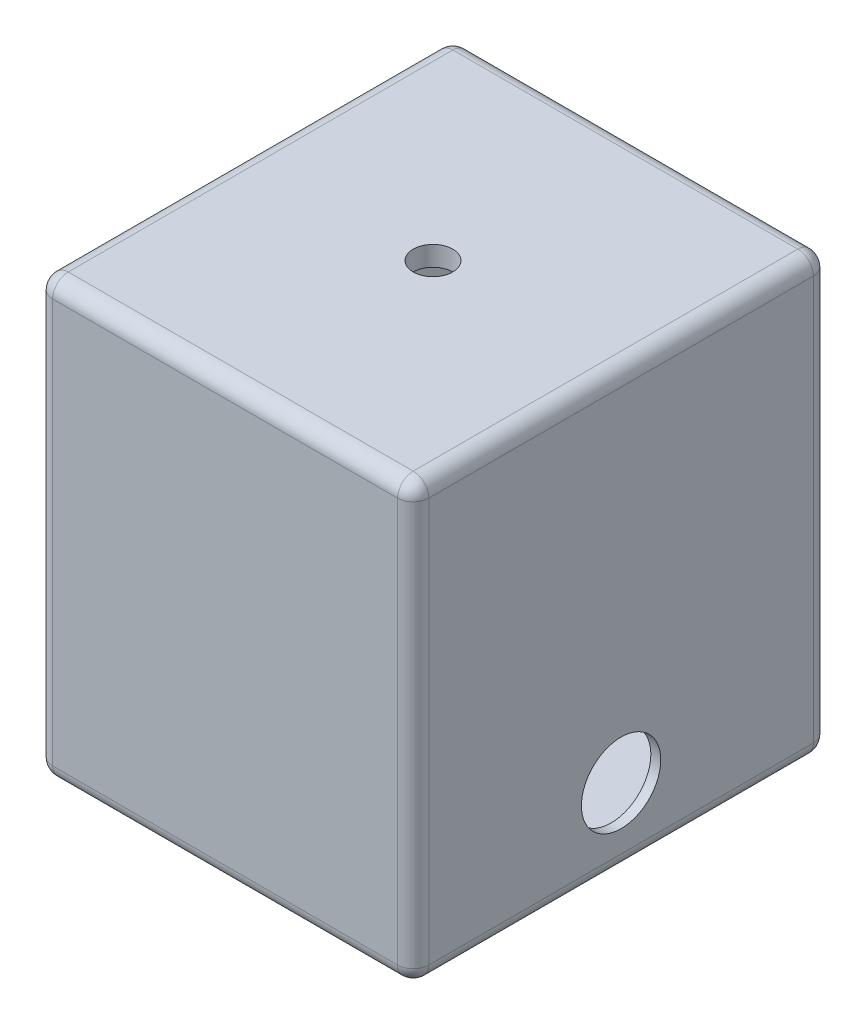
ISO-10303-21;
HEADER;
FILE_DESCRIPTION(('STEP AP214'),'2;1');
FILE_NAME('part.step','',(''),(''),'','','');
FILE_SCHEMA(('AUTOMOTIVE_DESIGN { 1 0 10303 214 1 1 1 1 }'));
ENDSEC;
DATA;
#1=APPLICATION_CONTEXT('core data for automotive mechanical design processes');
#2=APPLICATION_PROTOCOL_DEFINITION('international standard','automotive_design',2000,#1);
#3=PRODUCT_CONTEXT('',#1,'mechanical');
#4=PRODUCT('Part','Part','',(#3));
#5=PRODUCT_RELATED_PRODUCT_CATEGORY('part','',(#4));
#6=PRODUCT_DEFINITION_FORMATION('','',#4);
#7=PRODUCT_DEFINITION_CONTEXT('part definition',#1,'design');
#8=PRODUCT_DEFINITION('design','',#6,#7);
#9=PRODUCT_DEFINITION_SHAPE('','',#8);
#10=(LENGTH_UNIT() NAMED_UNIT(*) SI_UNIT(.MILLI.,.METRE.));
#11=(NAMED_UNIT(*) PLANE_ANGLE_UNIT() SI_UNIT($,.RADIAN.));
#12=(NAMED_UNIT(*) SI_UNIT($,.STERADIAN.) SOLID_ANGLE_UNIT());
#13=UNCERTAINTY_MEASURE_WITH_UNIT(LENGTH_MEASURE(1.E-05),#10,'distance_accuracy_value','');
#14=(GEOMETRIC_REPRESENTATION_CONTEXT(3) GLOBAL_UNCERTAINTY_ASSIGNED_CONTEXT((#13)) GLOBAL_UNIT_ASSIGNED_CONTEXT((#10,
#11,#12)) REPRESENTATION_CONTEXT('',''));
#15=CARTESIAN_POINT('',(0.,0.,0.));
#16=DIRECTION('',(0.,0.,1.));
#17=DIRECTION('',(1.,0.,0.));
#18=AXIS2_PLACEMENT_3D('',#15,#16,#17);
#19=CARTESIAN_POINT('',(0.,12.7,0.));
#20=DIRECTION('',(0.,-1.,0.));
#21=DIRECTION('',(0.,0.,-1.));
#22=AXIS2_PLACEMENT_3D('',#19,#20,#21);
#23=PLANE('',#22);
#24=DIRECTION('',(0.,0.,-1.));
#25=VECTOR('',#24,1.);
#26=CARTESIAN_POINT('',(114.3,12.7,127.));
#27=LINE('',#26,#25);
#28=CARTESIAN_POINT('',(114.3,12.7,127.));
#29=VERTEX_POINT('',#28);
#30=CARTESIAN_POINT('',(114.3,12.7,-127.));
#31=VERTEX_POINT('',#30);
#32=EDGE_CURVE('E178',#29,#31,#27,.T.);
#33=ORIENTED_EDGE('',*,*,#32,.T.);
#34=DIRECTION('',(-1.,0.,0.));
#35=VECTOR('',#34,1.);
#36=CARTESIAN_POINT('',(-114.3,12.7,-127.));
#37=LINE('',#36,#35);
#38=CARTESIAN_POINT('',(-114.3,12.7,-127.));
#39=VERTEX_POINT('',#38);
#40=EDGE_CURVE('E697',#31,#39,#37,.T.);
#41=ORIENTED_EDGE('',*,*,#40,.T.);
#42=DIRECTION('',(0.,0.,1.));
#43=VECTOR('',#42,1.);
#44=CARTESIAN_POINT('',(-114.3,12.7,127.));
#45=LINE('',#44,#43);
#46=CARTESIAN_POINT('',(-114.3,12.7,127.));
#47=VERTEX_POINT('',#46);
#48=EDGE_CURVE('E162',#39,#47,#45,.T.);
#49=ORIENTED_EDGE('',*,*,#48,.T.);
#50=DIRECTION('',(1.,0.,0.));
#51=VECTOR('',#50,1.);
#52=CARTESIAN_POINT('',(-114.3,12.7,127.));
#53=LINE('',#52,#51);
#54=EDGE_CURVE('E185',#47,#29,#53,.T.);
#55=ORIENTED_EDGE('',*,*,#54,.T.);
#56=EDGE_LOOP('',(#33,#41,#49,#55));
#57=FACE_BOUND('',#56,.T.);
#58=ADVANCED_FACE('F32',(#57),#23,.F.);
#59=CARTESIAN_POINT('',(-114.3,12.7,127.));
#60=DIRECTION('',(-1.,0.,0.));
#61=DIRECTION('',(0.,0.,1.));
#62=AXIS2_PLACEMENT_3D('',#59,#60,#61);
#63=PLANE('',#62);
#64=DIRECTION('',(0.,0.,1.));
#65=VECTOR('',#64,1.);
#66=CARTESIAN_POINT('',(-114.3,266.7,127.));
#67=LINE('',#66,#65);
#68=CARTESIAN_POINT('',(-114.3,266.7,-127.));
#69=VERTEX_POINT('',#68);
#70=CARTESIAN_POINT('',(-114.3,266.7,127.));
#71=VERTEX_POINT('',#70);
#72=EDGE_CURVE('E147',#69,#71,#67,.T.);
#73=ORIENTED_EDGE('',*,*,#72,.T.);
#74=DIRECTION('',(0.,1.,0.));
#75=VECTOR('',#74,1.);
#76=CARTESIAN_POINT('',(-114.3,12.7,127.));
#77=LINE('',#76,#75);
#78=EDGE_CURVE('E166',#47,#71,#77,.T.);
#79=ORIENTED_EDGE('',*,*,#78,.F.);
#80=ORIENTED_EDGE('',*,*,#48,.F.);
#81=DIRECTION('',(0.,1.,0.));
#82=VECTOR('',#81,1.);
#83=CARTESIAN_POINT('',(-114.3,12.7,-127.));
#84=LINE('',#83,#82);
#85=EDGE_CURVE('E159',#39,#69,#84,.T.);
#86=ORIENTED_EDGE('',*,*,#85,.T.);
#87=EDGE_LOOP('',(#73,#79,#80,#86));
#88=FACE_BOUND('',#87,.T.);
#89=ADVANCED_FACE('F160',(#88),#63,.F.);
#90=CARTESIAN_POINT('',(-114.3,12.7,127.));
#91=DIRECTION('',(0.,0.,1.));
#92=DIRECTION('',(1.,0.,0.));
#93=AXIS2_PLACEMENT_3D('',#90,#91,#92);
#94=PLANE('',#93);
#95=DIRECTION('',(1.,0.,0.));
#96=VECTOR('',#95,1.);
#97=CARTESIAN_POINT('',(-114.3,266.7,127.));
#98=LINE('',#97,#96);
#99=CARTESIAN_POINT('',(114.3,266.7,127.));
#100=VERTEX_POINT('',#99);
#101=EDGE_CURVE('E154',#71,#100,#98,.T.);
#102=ORIENTED_EDGE('',*,*,#101,.T.);
#103=DIRECTION('',(0.,1.,0.));
#104=VECTOR('',#103,1.);
#105=CARTESIAN_POINT('',(114.3,12.7,127.));
#106=LINE('',#105,#104);
#107=EDGE_CURVE('E179',#29,#100,#106,.T.);
#108=ORIENTED_EDGE('',*,*,#107,.F.);
#109=ORIENTED_EDGE('',*,*,#54,.F.);
#110=ORIENTED_EDGE('',*,*,#78,.T.);
#111=EDGE_LOOP('',(#102,#108,#109,#110));
#112=FACE_BOUND('',#111,.T.);
#113=ADVANCED_FACE('F384',(#112),#94,.F.);
#114=CARTESIAN_POINT('',(114.3,12.7,127.));
#115=DIRECTION('',(1.,0.,0.));
#116=DIRECTION('',(0.,0.,-1.));
#117=AXIS2_PLACEMENT_3D('',#114,#115,#116);
#118=PLANE('',#117);
#119=CARTESIAN_POINT('',(114.3,49.5397175201975,0.));
#120=DIRECTION('',(1.,0.,0.));
#121=DIRECTION('',(0.,0.,-1.));
#122=AXIS2_PLACEMENT_3D('',#119,#120,#121);
#123=CIRCLE('',#122,25.451039799919);
#124=CARTESIAN_POINT('',(114.3,49.5397175201975,-25.451039799919));
#125=VERTEX_POINT('',#124);
#126=EDGE_CURVE('E36',#125,#125,#123,.T.);
#127=ORIENTED_EDGE('',*,*,#126,.T.);
#128=EDGE_LOOP('',(#127));
#129=FACE_BOUND('',#128,.T.);
#130=DIRECTION('',(0.,0.,-1.));
#131=VECTOR('',#130,1.);
#132=CARTESIAN_POINT('',(114.3,266.7,127.));
#133=LINE('',#132,#131);
#134=CARTESIAN_POINT('',(114.3,266.7,-127.));
#135=VERTEX_POINT('',#134);
#136=EDGE_CURVE('E171',#100,#135,#133,.T.);
#137=ORIENTED_EDGE('',*,*,#136,.T.);
#138=DIRECTION('',(0.,1.,0.));
#139=VECTOR('',#138,1.);
#140=CARTESIAN_POINT('',(114.3,12.7,-127.));
#141=LINE('',#140,#139);
#142=EDGE_CURVE('E167',#31,#135,#141,.T.);
#143=ORIENTED_EDGE('',*,*,#142,.F.);
#144=ORIENTED_EDGE('',*,*,#32,.F.);
#145=ORIENTED_EDGE('',*,*,#107,.T.);
#146=EDGE_LOOP('',(#137,#143,#144,#145));
#147=FACE_BOUND('',#146,.T.);
#148=ADVANCED_FACE('F391',(#129,#147),#118,.F.);
#149=CARTESIAN_POINT('',(-114.3,12.7,-127.));
#150=DIRECTION('',(0.,0.,-1.));
#151=DIRECTION('',(-1.,0.,0.));
#152=AXIS2_PLACEMENT_3D('',#149,#150,#151);
#153=PLANE('',#152);
#154=DIRECTION('',(-1.,0.,0.));
#155=VECTOR('',#154,1.);
#156=CARTESIAN_POINT('',(-114.3,266.7,-127.));
#157=LINE('',#156,#155);
#158=EDGE_CURVE('E151',#135,#69,#157,.T.);
#159=ORIENTED_EDGE('',*,*,#158,.T.);
#160=ORIENTED_EDGE('',*,*,#85,.F.);
#161=ORIENTED_EDGE('',*,*,#40,.F.);
#162=ORIENTED_EDGE('',*,*,#142,.T.);
#163=EDGE_LOOP('',(#159,#160,#161,#162));
#164=FACE_BOUND('',#163,.T.);
#165=ADVANCED_FACE('F170',(#164),#153,.F.);
#166=CARTESIAN_POINT('',(0.,266.7,0.));
#167=DIRECTION('',(0.,-1.,0.));
#168=DIRECTION('',(0.,0.,-1.));
#169=AXIS2_PLACEMENT_3D('',#166,#167,#168);
#170=PLANE('',#169);
#171=CARTESIAN_POINT('',(0.,266.7,0.));
#172=DIRECTION('',(0.,1.,0.));
#173=DIRECTION('',(0.,0.,1.));
#174=AXIS2_PLACEMENT_3D('',#171,#172,#173);
#175=CIRCLE('',#174,12.7);
#176=CARTESIAN_POINT('',(0.,266.7,12.7));
#177=VERTEX_POINT('',#176);
#178=EDGE_CURVE('E689',#177,#177,#175,.T.);
#179=ORIENTED_EDGE('',*,*,#178,.T.);
#180=EDGE_LOOP('',(#179));
#181=FACE_BOUND('',#180,.T.);
#182=ORIENTED_EDGE('',*,*,#158,.F.);
#183=ORIENTED_EDGE('',*,*,#136,.F.);
#184=ORIENTED_EDGE('',*,*,#101,.F.);
#185=ORIENTED_EDGE('',*,*,#72,.F.);
#186=EDGE_LOOP('',(#182,#183,#184,#185));
#187=FACE_BOUND('',#186,.T.);
#188=ADVANCED_FACE('F149',(#181,#187),#170,.T.);
#189=CARTESIAN_POINT('',(107.95,49.5397175201975,0.));
#190=DIRECTION('',(1.,0.,0.));
#191=DIRECTION('',(0.,0.,-1.));
#192=AXIS2_PLACEMENT_3D('',#189,#190,#191);
#193=CYLINDRICAL_SURFACE('',#192,25.451039799919);
#194=CARTESIAN_POINT('',(120.65,49.5397175201975,0.));
#195=DIRECTION('',(1.,0.,0.));
#196=DIRECTION('',(0.,0.,-1.));
#197=AXIS2_PLACEMENT_3D('',#194,#195,#196);
#198=CIRCLE('',#197,25.451039799919);
#199=CARTESIAN_POINT('',(120.65,49.5397175201975,-25.451039799919));
#200=VERTEX_POINT('',#199);
#201=EDGE_CURVE('E686',#200,#200,#198,.T.);
#202=ORIENTED_EDGE('',*,*,#201,.T.);
#203=EDGE_LOOP('',(#202));
#204=FACE_BOUND('',#203,.T.);
#205=ORIENTED_EDGE('',*,*,#126,.F.);
#206=EDGE_LOOP('',(#205));
#207=FACE_BOUND('',#206,.T.);
#208=ADVANCED_FACE('F414',(#204,#207),#193,.F.);
#209=CARTESIAN_POINT('',(120.65,266.7,133.35));
#210=DIRECTION('',(-1.,0.,0.));
#211=DIRECTION('',(0.,0.,1.));
#212=AXIS2_PLACEMENT_3D('',#209,#210,#211);
#213=PLANE('',#212);
#214=ORIENTED_EDGE('',*,*,#201,.F.);
#215=EDGE_LOOP('',(#214));
#216=FACE_BOUND('',#215,.T.);
#217=DIRECTION('',(0.,-1.,0.));
#218=VECTOR('',#217,1.);
#219=CARTESIAN_POINT('',(120.65,266.7,123.35));
#220=LINE('',#219,#218);
#221=CARTESIAN_POINT('',(120.65,269.4,123.35));
#222=VERTEX_POINT('',#221);
#223=CARTESIAN_POINT('',(120.65,10.,123.35));
#224=VERTEX_POINT('',#223);
#225=EDGE_CURVE('E56',#222,#224,#220,.T.);
#226=ORIENTED_EDGE('',*,*,#225,.T.);
#227=DIRECTION('',(0.,0.,-1.));
#228=VECTOR('',#227,1.);
#229=CARTESIAN_POINT('',(120.65,10.,-133.35));
#230=LINE('',#229,#228);
#231=CARTESIAN_POINT('',(120.65,10.,-123.35));
#232=VERTEX_POINT('',#231);
#233=EDGE_CURVE('E11',#224,#232,#230,.T.);
#234=ORIENTED_EDGE('',*,*,#233,.T.);
#235=DIRECTION('',(0.,-1.,0.));
#236=VECTOR('',#235,1.);
#237=CARTESIAN_POINT('',(120.65,266.7,-123.35));
#238=LINE('',#237,#236);
#239=CARTESIAN_POINT('',(120.65,269.4,-123.35));
#240=VERTEX_POINT('',#239);
#241=EDGE_CURVE('E41',#232,#240,#238,.F.);
#242=ORIENTED_EDGE('',*,*,#241,.T.);
#243=DIRECTION('',(0.,0.,-1.));
#244=VECTOR('',#243,1.);
#245=CARTESIAN_POINT('',(120.65,269.4,133.35));
#246=LINE('',#245,#244);
#247=EDGE_CURVE('E230',#240,#222,#246,.F.);
#248=ORIENTED_EDGE('',*,*,#247,.T.);
#249=EDGE_LOOP('',(#226,#234,#242,#248));
#250=FACE_BOUND('',#249,.T.);
#251=ADVANCED_FACE('F411',(#216,#250),#213,.F.);
#252=CARTESIAN_POINT('',(-120.65,266.7,-133.35));
#253=DIRECTION('',(0.,0.,1.));
#254=DIRECTION('',(1.,0.,0.));
#255=AXIS2_PLACEMENT_3D('',#252,#253,#254);
#256=PLANE('',#255);
#257=DIRECTION('',(0.,-1.,0.));
#258=VECTOR('',#257,1.);
#259=CARTESIAN_POINT('',(-110.65,266.7,-133.35));
#260=LINE('',#259,#258);
#261=CARTESIAN_POINT('',(-110.65,10.,-133.35));
#262=VERTEX_POINT('',#261);
#263=CARTESIAN_POINT('',(-110.65,269.4,-133.35));
#264=VERTEX_POINT('',#263);
#265=EDGE_CURVE('E225',#262,#264,#260,.F.);
#266=ORIENTED_EDGE('',*,*,#265,.T.);
#267=DIRECTION('',(-1.,0.,0.));
#268=VECTOR('',#267,1.);
#269=CARTESIAN_POINT('',(-120.65,269.4,-133.35));
#270=LINE('',#269,#268);
#271=CARTESIAN_POINT('',(110.65,269.4,-133.35));
#272=VERTEX_POINT('',#271);
#273=EDGE_CURVE('E227',#264,#272,#270,.F.);
#274=ORIENTED_EDGE('',*,*,#273,.T.);
#275=DIRECTION('',(0.,-1.,0.));
#276=VECTOR('',#275,1.);
#277=CARTESIAN_POINT('',(110.65,266.7,-133.35));
#278=LINE('',#277,#276);
#279=CARTESIAN_POINT('',(110.65,10.,-133.35));
#280=VERTEX_POINT('',#279);
#281=EDGE_CURVE('E221',#272,#280,#278,.T.);
#282=ORIENTED_EDGE('',*,*,#281,.T.);
#283=DIRECTION('',(-1.,0.,0.));
#284=VECTOR('',#283,1.);
#285=CARTESIAN_POINT('',(-120.65,10.,-133.35));
#286=LINE('',#285,#284);
#287=EDGE_CURVE('E223',#280,#262,#286,.T.);
#288=ORIENTED_EDGE('',*,*,#287,.T.);
#289=EDGE_LOOP('',(#266,#274,#282,#288));
#290=FACE_BOUND('',#289,.T.);
#291=ADVANCED_FACE('F347',(#290),#256,.F.);
#292=CARTESIAN_POINT('',(-120.65,266.7,133.35));
#293=DIRECTION('',(1.,0.,0.));
#294=DIRECTION('',(0.,0.,-1.));
#295=AXIS2_PLACEMENT_3D('',#292,#293,#294);
#296=PLANE('',#295);
#297=DIRECTION('',(0.,0.,1.));
#298=VECTOR('',#297,1.);
#299=CARTESIAN_POINT('',(-120.65,10.,133.35));
#300=LINE('',#299,#298);
#301=CARTESIAN_POINT('',(-120.65,10.,-123.35));
#302=VERTEX_POINT('',#301);
#303=CARTESIAN_POINT('',(-120.65,10.,123.35));
#304=VERTEX_POINT('',#303);
#305=EDGE_CURVE('E207',#302,#304,#300,.T.);
#306=ORIENTED_EDGE('',*,*,#305,.T.);
#307=DIRECTION('',(0.,-1.,0.));
#308=VECTOR('',#307,1.);
#309=CARTESIAN_POINT('',(-120.65,266.7,123.35));
#310=LINE('',#309,#308);
#311=CARTESIAN_POINT('',(-120.65,269.4,123.35));
#312=VERTEX_POINT('',#311);
#313=EDGE_CURVE('E209',#304,#312,#310,.F.);
#314=ORIENTED_EDGE('',*,*,#313,.T.);
#315=DIRECTION('',(0.,0.,1.));
#316=VECTOR('',#315,1.);
#317=CARTESIAN_POINT('',(-120.65,269.4,133.35));
#318=LINE('',#317,#316);
#319=CARTESIAN_POINT('',(-120.65,269.4,-123.35));
#320=VERTEX_POINT('',#319);
#321=EDGE_CURVE('E205',#312,#320,#318,.F.);
#322=ORIENTED_EDGE('',*,*,#321,.T.);
#323=DIRECTION('',(0.,-1.,0.));
#324=VECTOR('',#323,1.);
#325=CARTESIAN_POINT('',(-120.65,266.7,-123.35));
#326=LINE('',#325,#324);
#327=EDGE_CURVE('E203',#320,#302,#326,.T.);
#328=ORIENTED_EDGE('',*,*,#327,.T.);
#329=EDGE_LOOP('',(#306,#314,#322,#328));
#330=FACE_BOUND('',#329,.T.);
#331=ADVANCED_FACE('F313',(#330),#296,.F.);
#332=CARTESIAN_POINT('',(-120.65,266.7,133.35));
#333=DIRECTION('',(0.,0.,-1.));
#334=DIRECTION('',(-1.,0.,0.));
#335=AXIS2_PLACEMENT_3D('',#332,#333,#334);
#336=PLANE('',#335);
#337=DIRECTION('',(0.,-1.,0.));
#338=VECTOR('',#337,1.);
#339=CARTESIAN_POINT('',(-110.65,266.7,133.35));
#340=LINE('',#339,#338);
#341=CARTESIAN_POINT('',(-110.65,269.4,133.35));
#342=VERTEX_POINT('',#341);
#343=CARTESIAN_POINT('',(-110.65,10.,133.35));
#344=VERTEX_POINT('',#343);
#345=EDGE_CURVE('E189',#342,#344,#340,.T.);
#346=ORIENTED_EDGE('',*,*,#345,.T.);
#347=DIRECTION('',(1.,0.,0.));
#348=VECTOR('',#347,1.);
#349=CARTESIAN_POINT('',(120.65,10.,133.35));
#350=LINE('',#349,#348);
#351=CARTESIAN_POINT('',(110.65,10.,133.35));
#352=VERTEX_POINT('',#351);
#353=EDGE_CURVE('E191',#344,#352,#350,.T.);
#354=ORIENTED_EDGE('',*,*,#353,.T.);
#355=DIRECTION('',(0.,-1.,0.));
#356=VECTOR('',#355,1.);
#357=CARTESIAN_POINT('',(110.65,266.7,133.35));
#358=LINE('',#357,#356);
#359=CARTESIAN_POINT('',(110.65,269.4,133.35));
#360=VERTEX_POINT('',#359);
#361=EDGE_CURVE('E182',#352,#360,#358,.F.);
#362=ORIENTED_EDGE('',*,*,#361,.T.);
#363=DIRECTION('',(1.,0.,0.));
#364=VECTOR('',#363,1.);
#365=CARTESIAN_POINT('',(-120.65,269.4,133.35));
#366=LINE('',#365,#364);
#367=EDGE_CURVE('E187',#360,#342,#366,.F.);
#368=ORIENTED_EDGE('',*,*,#367,.T.);
#369=EDGE_LOOP('',(#346,#354,#362,#368));
#370=FACE_BOUND('',#369,.T.);
#371=ADVANCED_FACE('F402',(#370),#336,.F.);
#372=CARTESIAN_POINT('',(0.,0.,0.));
#373=DIRECTION('',(0.,-1.,0.));
#374=DIRECTION('',(0.,0.,-1.));
#375=AXIS2_PLACEMENT_3D('',#372,#373,#374);
#376=PLANE('',#375);
#377=DIRECTION('',(0.,0.,-1.));
#378=VECTOR('',#377,1.);
#379=CARTESIAN_POINT('',(110.65,0.,133.35));
#380=LINE('',#379,#378);
#381=CARTESIAN_POINT('',(110.65,0.,-123.35));
#382=VERTEX_POINT('',#381);
#383=CARTESIAN_POINT('',(110.65,0.,123.35));
#384=VERTEX_POINT('',#383);
#385=EDGE_CURVE('E194',#382,#384,#380,.F.);
#386=ORIENTED_EDGE('',*,*,#385,.T.);
#387=DIRECTION('',(1.,0.,0.));
#388=VECTOR('',#387,1.);
#389=CARTESIAN_POINT('',(-120.65,0.,123.35));
#390=LINE('',#389,#388);
#391=CARTESIAN_POINT('',(-110.65,0.,123.35));
#392=VERTEX_POINT('',#391);
#393=EDGE_CURVE('E200',#384,#392,#390,.F.);
#394=ORIENTED_EDGE('',*,*,#393,.T.);
#395=DIRECTION('',(0.,0.,1.));
#396=VECTOR('',#395,1.);
#397=CARTESIAN_POINT('',(-110.65,0.,-133.35));
#398=LINE('',#397,#396);
#399=CARTESIAN_POINT('',(-110.65,0.,-123.35));
#400=VERTEX_POINT('',#399);
#401=EDGE_CURVE('E198',#392,#400,#398,.F.);
#402=ORIENTED_EDGE('',*,*,#401,.T.);
#403=DIRECTION('',(-1.,0.,0.));
#404=VECTOR('',#403,1.);
#405=CARTESIAN_POINT('',(120.65,0.,-123.35));
#406=LINE('',#405,#404);
#407=EDGE_CURVE('E196',#400,#382,#406,.F.);
#408=ORIENTED_EDGE('',*,*,#407,.T.);
#409=EDGE_LOOP('',(#386,#394,#402,#408));
#410=FACE_BOUND('',#409,.T.);
#411=ADVANCED_FACE('F399',(#410),#376,.T.);
#412=CARTESIAN_POINT('',(0.,279.4,0.));
#413=DIRECTION('',(0.,-1.,0.));
#414=DIRECTION('',(0.,0.,-1.));
#415=AXIS2_PLACEMENT_3D('',#412,#413,#414);
#416=PLANE('',#415);
#417=CARTESIAN_POINT('',(0.,279.4,0.));
#418=DIRECTION('',(0.,1.,0.));
#419=DIRECTION('',(0.,0.,1.));
#420=AXIS2_PLACEMENT_3D('',#417,#418,#419);
#421=CIRCLE('',#420,12.7);
#422=CARTESIAN_POINT('',(0.,279.4,12.7));
#423=VERTEX_POINT('',#422);
#424=EDGE_CURVE('E692',#423,#423,#421,.T.);
#425=ORIENTED_EDGE('',*,*,#424,.F.);
#426=EDGE_LOOP('',(#425));
#427=FACE_BOUND('',#426,.T.);
#428=DIRECTION('',(0.,0.,1.));
#429=VECTOR('',#428,1.);
#430=CARTESIAN_POINT('',(-110.65,279.4,0.));
#431=LINE('',#430,#429);
#432=CARTESIAN_POINT('',(-110.65,279.4,-123.35));
#433=VERTEX_POINT('',#432);
#434=CARTESIAN_POINT('',(-110.65,279.4,123.35));
#435=VERTEX_POINT('',#434);
#436=EDGE_CURVE('E216',#433,#435,#431,.T.);
#437=ORIENTED_EDGE('',*,*,#436,.T.);
#438=DIRECTION('',(1.,0.,0.));
#439=VECTOR('',#438,1.);
#440=CARTESIAN_POINT('',(0.,279.4,123.35));
#441=LINE('',#440,#439);
#442=CARTESIAN_POINT('',(110.65,279.4,123.35));
#443=VERTEX_POINT('',#442);
#444=EDGE_CURVE('E218',#435,#443,#441,.T.);
#445=ORIENTED_EDGE('',*,*,#444,.T.);
#446=DIRECTION('',(0.,0.,-1.));
#447=VECTOR('',#446,1.);
#448=CARTESIAN_POINT('',(110.65,279.4,0.));
#449=LINE('',#448,#447);
#450=CARTESIAN_POINT('',(110.65,279.4,-123.35));
#451=VERTEX_POINT('',#450);
#452=EDGE_CURVE('E212',#443,#451,#449,.T.);
#453=ORIENTED_EDGE('',*,*,#452,.T.);
#454=DIRECTION('',(-1.,0.,0.));
#455=VECTOR('',#454,1.);
#456=CARTESIAN_POINT('',(0.,279.4,-123.35));
#457=LINE('',#456,#455);
#458=EDGE_CURVE('E214',#451,#433,#457,.T.);
#459=ORIENTED_EDGE('',*,*,#458,.T.);
#460=EDGE_LOOP('',(#437,#445,#453,#459));
#461=FACE_BOUND('',#460,.T.);
#462=ADVANCED_FACE('F322',(#427,#461),#416,.F.);
#463=CARTESIAN_POINT('',(0.,269.4,-123.35));
#464=DIRECTION('',(-1.,0.,0.));
#465=DIRECTION('',(0.,0.,1.));
#466=AXIS2_PLACEMENT_3D('',#463,#464,#465);
#467=CYLINDRICAL_SURFACE('',#466,10.);
#468=CARTESIAN_POINT('',(-110.65,269.4,-123.35));
#469=DIRECTION('',(-1.,0.,0.));
#470=DIRECTION('',(0.,0.,1.));
#471=AXIS2_PLACEMENT_3D('',#468,#469,#470);
#472=CIRCLE('',#471,10.);
#473=EDGE_CURVE('E173',#433,#264,#472,.T.);
#474=ORIENTED_EDGE('',*,*,#473,.F.);
#475=ORIENTED_EDGE('',*,*,#458,.F.);
#476=CARTESIAN_POINT('',(110.65,269.4,-123.35));
#477=DIRECTION('',(1.,0.,0.));
#478=DIRECTION('',(0.,1.,0.));
#479=AXIS2_PLACEMENT_3D('',#476,#477,#478);
#480=CIRCLE('',#479,10.);
#481=EDGE_CURVE('E293',#272,#451,#480,.T.);
#482=ORIENTED_EDGE('',*,*,#481,.F.);
#483=ORIENTED_EDGE('',*,*,#273,.F.);
#484=EDGE_LOOP('',(#474,#475,#482,#483));
#485=FACE_BOUND('',#484,.T.);
#486=ADVANCED_FACE('F34',(#485),#467,.T.);
#487=CARTESIAN_POINT('',(-110.65,269.4,-123.35));
#488=DIRECTION('',(0.,0.,-1.));
#489=DIRECTION('',(-1.,0.,0.));
#490=AXIS2_PLACEMENT_3D('',#487,#488,#489);
#491=SPHERICAL_SURFACE('',#490,10.);
#492=CARTESIAN_POINT('',(-110.65,269.4,-123.35));
#493=DIRECTION('',(0.,0.,-1.));
#494=DIRECTION('',(0.,1.,0.));
#495=AXIS2_PLACEMENT_3D('',#492,#493,#494);
#496=CIRCLE('',#495,10.);
#497=EDGE_CURVE('E287',#433,#320,#496,.F.);
#498=ORIENTED_EDGE('',*,*,#497,.F.);
#499=ORIENTED_EDGE('',*,*,#473,.T.);
#500=CARTESIAN_POINT('',(-110.65,269.4,-123.35));
#501=DIRECTION('',(0.,1.,0.));
#502=DIRECTION('',(0.,0.,1.));
#503=AXIS2_PLACEMENT_3D('',#500,#501,#502);
#504=CIRCLE('',#503,10.);
#505=EDGE_CURVE('E290',#320,#264,#504,.F.);
#506=ORIENTED_EDGE('',*,*,#505,.F.);
#507=EDGE_LOOP('',(#498,#499,#506));
#508=FACE_BOUND('',#507,.T.);
#509=ADVANCED_FACE('F300',(#508),#491,.T.);
#510=CARTESIAN_POINT('',(110.65,269.4,-123.35));
#511=DIRECTION('',(0.,1.,0.));
#512=DIRECTION('',(0.,0.,1.));
#513=AXIS2_PLACEMENT_3D('',#510,#511,#512);
#514=SPHERICAL_SURFACE('',#513,10.);
#515=CARTESIAN_POINT('',(110.65,269.4,-123.35));
#516=DIRECTION('',(0.,1.,0.));
#517=DIRECTION('',(0.,0.,1.));
#518=AXIS2_PLACEMENT_3D('',#515,#516,#517);
#519=CIRCLE('',#518,10.);
#520=EDGE_CURVE('E281',#272,#240,#519,.F.);
#521=ORIENTED_EDGE('',*,*,#520,.F.);
#522=ORIENTED_EDGE('',*,*,#481,.T.);
#523=CARTESIAN_POINT('',(110.65,269.4,-123.35));
#524=DIRECTION('',(0.,0.,-1.));
#525=DIRECTION('',(-1.,0.,0.));
#526=AXIS2_PLACEMENT_3D('',#523,#524,#525);
#527=CIRCLE('',#526,10.);
#528=EDGE_CURVE('E284',#240,#451,#527,.F.);
#529=ORIENTED_EDGE('',*,*,#528,.F.);
#530=EDGE_LOOP('',(#521,#522,#529));
#531=FACE_BOUND('',#530,.T.);
#532=ADVANCED_FACE('F340',(#531),#514,.T.);
#533=CARTESIAN_POINT('',(-110.65,266.7,-123.35));
#534=DIRECTION('',(0.,-1.,0.));
#535=DIRECTION('',(0.,0.,-1.));
#536=AXIS2_PLACEMENT_3D('',#533,#534,#535);
#537=CYLINDRICAL_SURFACE('',#536,10.);
#538=ORIENTED_EDGE('',*,*,#505,.T.);
#539=ORIENTED_EDGE('',*,*,#265,.F.);
#540=CARTESIAN_POINT('',(-110.65,10.,-123.35));
#541=DIRECTION('',(0.,-1.,0.));
#542=DIRECTION('',(0.,0.,-1.));
#543=AXIS2_PLACEMENT_3D('',#540,#541,#542);
#544=CIRCLE('',#543,10.);
#545=EDGE_CURVE('E275',#302,#262,#544,.T.);
#546=ORIENTED_EDGE('',*,*,#545,.F.);
#547=ORIENTED_EDGE('',*,*,#327,.F.);
#548=EDGE_LOOP('',(#538,#539,#546,#547));
#549=FACE_BOUND('',#548,.T.);
#550=ADVANCED_FACE('F308',(#549),#537,.T.);
#551=CARTESIAN_POINT('',(-110.65,269.4,0.));
#552=DIRECTION('',(0.,0.,1.));
#553=DIRECTION('',(1.,0.,0.));
#554=AXIS2_PLACEMENT_3D('',#551,#552,#553);
#555=CYLINDRICAL_SURFACE('',#554,10.);
#556=ORIENTED_EDGE('',*,*,#497,.T.);
#557=ORIENTED_EDGE('',*,*,#321,.F.);
#558=CARTESIAN_POINT('',(-110.65,269.4,123.35));
#559=DIRECTION('',(0.,0.,1.));
#560=DIRECTION('',(1.,0.,0.));
#561=AXIS2_PLACEMENT_3D('',#558,#559,#560);
#562=CIRCLE('',#561,10.);
#563=EDGE_CURVE('E272',#435,#312,#562,.T.);
#564=ORIENTED_EDGE('',*,*,#563,.F.);
#565=ORIENTED_EDGE('',*,*,#436,.F.);
#566=EDGE_LOOP('',(#556,#557,#564,#565));
#567=FACE_BOUND('',#566,.T.);
#568=ADVANCED_FACE('F319',(#567),#555,.T.);
#569=CARTESIAN_POINT('',(0.,269.4,123.35));
#570=DIRECTION('',(1.,0.,0.));
#571=DIRECTION('',(0.,0.,-1.));
#572=AXIS2_PLACEMENT_3D('',#569,#570,#571);
#573=CYLINDRICAL_SURFACE('',#572,10.);
#574=CARTESIAN_POINT('',(110.65,269.4,123.35));
#575=DIRECTION('',(1.,0.,0.));
#576=DIRECTION('',(0.,0.,-1.));
#577=AXIS2_PLACEMENT_3D('',#574,#575,#576);
#578=CIRCLE('',#577,10.);
#579=EDGE_CURVE('E266',#443,#360,#578,.T.);
#580=ORIENTED_EDGE('',*,*,#579,.F.);
#581=ORIENTED_EDGE('',*,*,#444,.F.);
#582=CARTESIAN_POINT('',(-110.65,269.4,123.35));
#583=DIRECTION('',(-1.,0.,0.));
#584=DIRECTION('',(0.,0.,1.));
#585=AXIS2_PLACEMENT_3D('',#582,#583,#584);
#586=CIRCLE('',#585,10.);
#587=EDGE_CURVE('E269',#342,#435,#586,.T.);
#588=ORIENTED_EDGE('',*,*,#587,.F.);
#589=ORIENTED_EDGE('',*,*,#367,.F.);
#590=EDGE_LOOP('',(#580,#581,#588,#589));
#591=FACE_BOUND('',#590,.T.);
#592=ADVANCED_FACE('F326',(#591),#573,.T.);
#593=CARTESIAN_POINT('',(110.65,269.4,0.));
#594=DIRECTION('',(0.,0.,-1.));
#595=DIRECTION('',(-1.,0.,0.));
#596=AXIS2_PLACEMENT_3D('',#593,#594,#595);
#597=CYLINDRICAL_SURFACE('',#596,10.);
#598=ORIENTED_EDGE('',*,*,#528,.T.);
#599=ORIENTED_EDGE('',*,*,#452,.F.);
#600=CARTESIAN_POINT('',(110.65,269.4,123.35));
#601=DIRECTION('',(0.,0.,1.));
#602=DIRECTION('',(1.,0.,0.));
#603=AXIS2_PLACEMENT_3D('',#600,#601,#602);
#604=CIRCLE('',#603,10.);
#605=EDGE_CURVE('E264',#222,#443,#604,.T.);
#606=ORIENTED_EDGE('',*,*,#605,.F.);
#607=ORIENTED_EDGE('',*,*,#247,.F.);
#608=EDGE_LOOP('',(#598,#599,#606,#607));
#609=FACE_BOUND('',#608,.T.);
#610=ADVANCED_FACE('F334',(#609),#597,.T.);
#611=CARTESIAN_POINT('',(110.65,266.7,-123.35));
#612=DIRECTION('',(0.,-1.,0.));
#613=DIRECTION('',(0.,0.,-1.));
#614=AXIS2_PLACEMENT_3D('',#611,#612,#613);
#615=CYLINDRICAL_SURFACE('',#614,10.);
#616=ORIENTED_EDGE('',*,*,#520,.T.);
#617=ORIENTED_EDGE('',*,*,#241,.F.);
#618=CARTESIAN_POINT('',(110.65,10.,-123.35));
#619=DIRECTION('',(0.,-1.,0.));
#620=DIRECTION('',(0.,0.,-1.));
#621=AXIS2_PLACEMENT_3D('',#618,#619,#620);
#622=CIRCLE('',#621,10.);
#623=EDGE_CURVE('E262',#280,#232,#622,.T.);
#624=ORIENTED_EDGE('',*,*,#623,.F.);
#625=ORIENTED_EDGE('',*,*,#281,.F.);
#626=EDGE_LOOP('',(#616,#617,#624,#625));
#627=FACE_BOUND('',#626,.T.);
#628=ADVANCED_FACE('F343',(#627),#615,.T.);
#629=CARTESIAN_POINT('',(-120.65,10.,-123.35));
#630=DIRECTION('',(1.,0.,0.));
#631=DIRECTION('',(0.,0.,-1.));
#632=AXIS2_PLACEMENT_3D('',#629,#630,#631);
#633=CYLINDRICAL_SURFACE('',#632,10.);
#634=CARTESIAN_POINT('',(-110.65,10.,-123.35));
#635=DIRECTION('',(-1.,0.,0.));
#636=DIRECTION('',(0.,0.,1.));
#637=AXIS2_PLACEMENT_3D('',#634,#635,#636);
#638=CIRCLE('',#637,10.);
#639=EDGE_CURVE('E278',#262,#400,#638,.T.);
#640=ORIENTED_EDGE('',*,*,#639,.F.);
#641=ORIENTED_EDGE('',*,*,#287,.F.);
#642=CARTESIAN_POINT('',(110.65,10.,-123.35));
#643=DIRECTION('',(1.,0.,0.));
#644=DIRECTION('',(0.,0.,-1.));
#645=AXIS2_PLACEMENT_3D('',#642,#643,#644);
#646=CIRCLE('',#645,10.);
#647=EDGE_CURVE('E259',#382,#280,#646,.T.);
#648=ORIENTED_EDGE('',*,*,#647,.F.);
#649=ORIENTED_EDGE('',*,*,#407,.F.);
#650=EDGE_LOOP('',(#640,#641,#648,#649));
#651=FACE_BOUND('',#650,.T.);
#652=ADVANCED_FACE('F350',(#651),#633,.T.);
#653=CARTESIAN_POINT('',(-110.65,10.,-123.35));
#654=DIRECTION('',(0.,0.,-1.));
#655=DIRECTION('',(0.,1.,0.));
#656=AXIS2_PLACEMENT_3D('',#653,#654,#655);
#657=SPHERICAL_SURFACE('',#656,10.);
#658=ORIENTED_EDGE('',*,*,#545,.T.);
#659=ORIENTED_EDGE('',*,*,#639,.T.);
#660=CARTESIAN_POINT('',(-110.65,10.,-123.35));
#661=DIRECTION('',(0.,0.,-1.));
#662=DIRECTION('',(-1.,0.,0.));
#663=AXIS2_PLACEMENT_3D('',#660,#661,#662);
#664=CIRCLE('',#663,10.);
#665=EDGE_CURVE('E256',#302,#400,#664,.F.);
#666=ORIENTED_EDGE('',*,*,#665,.F.);
#667=EDGE_LOOP('',(#658,#659,#666));
#668=FACE_BOUND('',#667,.T.);
#669=ADVANCED_FACE('F353',(#668),#657,.T.);
#670=CARTESIAN_POINT('',(-110.65,269.4,123.35));
#671=DIRECTION('',(0.,1.,0.));
#672=DIRECTION('',(0.,0.,1.));
#673=AXIS2_PLACEMENT_3D('',#670,#671,#672);
#674=SPHERICAL_SURFACE('',#673,10.);
#675=ORIENTED_EDGE('',*,*,#587,.T.);
#676=ORIENTED_EDGE('',*,*,#563,.T.);
#677=CARTESIAN_POINT('',(-110.65,269.4,123.35));
#678=DIRECTION('',(0.,1.,0.));
#679=DIRECTION('',(0.,0.,1.));
#680=AXIS2_PLACEMENT_3D('',#677,#678,#679);
#681=CIRCLE('',#680,10.);
#682=EDGE_CURVE('E254',#342,#312,#681,.F.);
#683=ORIENTED_EDGE('',*,*,#682,.F.);
#684=EDGE_LOOP('',(#675,#676,#683));
#685=FACE_BOUND('',#684,.T.);
#686=ADVANCED_FACE('F367',(#685),#674,.T.);
#687=CARTESIAN_POINT('',(110.65,269.4,123.35));
#688=DIRECTION('',(0.,1.,0.));
#689=DIRECTION('',(0.,0.,1.));
#690=AXIS2_PLACEMENT_3D('',#687,#688,#689);
#691=SPHERICAL_SURFACE('',#690,10.);
#692=ORIENTED_EDGE('',*,*,#605,.T.);
#693=ORIENTED_EDGE('',*,*,#579,.T.);
#694=CARTESIAN_POINT('',(110.65,269.4,123.35));
#695=DIRECTION('',(0.,1.,0.));
#696=DIRECTION('',(0.,0.,1.));
#697=AXIS2_PLACEMENT_3D('',#694,#695,#696);
#698=CIRCLE('',#697,10.);
#699=EDGE_CURVE('E251',#222,#360,#698,.F.);
#700=ORIENTED_EDGE('',*,*,#699,.F.);
#701=EDGE_LOOP('',(#692,#693,#700));
#702=FACE_BOUND('',#701,.T.);
#703=ADVANCED_FACE('F369',(#702),#691,.T.);
#704=CARTESIAN_POINT('',(110.65,10.,-123.35));
#705=DIRECTION('',(0.,0.,-1.));
#706=DIRECTION('',(-1.,0.,0.));
#707=AXIS2_PLACEMENT_3D('',#704,#705,#706);
#708=SPHERICAL_SURFACE('',#707,10.);
#709=ORIENTED_EDGE('',*,*,#647,.T.);
#710=ORIENTED_EDGE('',*,*,#623,.T.);
#711=CARTESIAN_POINT('',(110.65,10.,-123.35));
#712=DIRECTION('',(0.,0.,-1.));
#713=DIRECTION('',(-1.,0.,0.));
#714=AXIS2_PLACEMENT_3D('',#711,#712,#713);
#715=CIRCLE('',#714,10.);
#716=EDGE_CURVE('E49',#382,#232,#715,.F.);
#717=ORIENTED_EDGE('',*,*,#716,.F.);
#718=EDGE_LOOP('',(#709,#710,#717));
#719=FACE_BOUND('',#718,.T.);
#720=ADVANCED_FACE('F375',(#719),#708,.T.);
#721=CARTESIAN_POINT('',(-110.65,10.,133.35));
#722=DIRECTION('',(0.,0.,-1.));
#723=DIRECTION('',(-1.,0.,0.));
#724=AXIS2_PLACEMENT_3D('',#721,#722,#723);
#725=CYLINDRICAL_SURFACE('',#724,10.);
#726=ORIENTED_EDGE('',*,*,#665,.T.);
#727=ORIENTED_EDGE('',*,*,#401,.F.);
#728=CARTESIAN_POINT('',(-110.65,10.,123.35));
#729=DIRECTION('',(0.,0.,1.));
#730=DIRECTION('',(1.,0.,0.));
#731=AXIS2_PLACEMENT_3D('',#728,#729,#730);
#732=CIRCLE('',#731,10.);
#733=EDGE_CURVE('E247',#304,#392,#732,.T.);
#734=ORIENTED_EDGE('',*,*,#733,.F.);
#735=ORIENTED_EDGE('',*,*,#305,.F.);
#736=EDGE_LOOP('',(#726,#727,#734,#735));
#737=FACE_BOUND('',#736,.T.);
#738=ADVANCED_FACE('F357',(#737),#725,.T.);
#739=CARTESIAN_POINT('',(-110.65,266.7,123.35));
#740=DIRECTION('',(0.,-1.,0.));
#741=DIRECTION('',(0.,0.,-1.));
#742=AXIS2_PLACEMENT_3D('',#739,#740,#741);
#743=CYLINDRICAL_SURFACE('',#742,10.);
#744=ORIENTED_EDGE('',*,*,#682,.T.);
#745=ORIENTED_EDGE('',*,*,#313,.F.);
#746=CARTESIAN_POINT('',(-110.65,10.,123.35));
#747=DIRECTION('',(0.,-1.,0.));
#748=DIRECTION('',(0.,0.,-1.));
#749=AXIS2_PLACEMENT_3D('',#746,#747,#748);
#750=CIRCLE('',#749,10.);
#751=EDGE_CURVE('E244',#344,#304,#750,.T.);
#752=ORIENTED_EDGE('',*,*,#751,.F.);
#753=ORIENTED_EDGE('',*,*,#345,.F.);
#754=EDGE_LOOP('',(#744,#745,#752,#753));
#755=FACE_BOUND('',#754,.T.);
#756=ADVANCED_FACE('F365',(#755),#743,.T.);
#757=CARTESIAN_POINT('',(110.65,266.7,123.35));
#758=DIRECTION('',(0.,-1.,0.));
#759=DIRECTION('',(0.,0.,-1.));
#760=AXIS2_PLACEMENT_3D('',#757,#758,#759);
#761=CYLINDRICAL_SURFACE('',#760,10.);
#762=ORIENTED_EDGE('',*,*,#699,.T.);
#763=ORIENTED_EDGE('',*,*,#361,.F.);
#764=CARTESIAN_POINT('',(110.65,10.,123.35));
#765=DIRECTION('',(0.,-1.,0.));
#766=DIRECTION('',(0.,0.,-1.));
#767=AXIS2_PLACEMENT_3D('',#764,#765,#766);
#768=CIRCLE('',#767,10.);
#769=EDGE_CURVE('E241',#224,#352,#768,.T.);
#770=ORIENTED_EDGE('',*,*,#769,.F.);
#771=ORIENTED_EDGE('',*,*,#225,.F.);
#772=EDGE_LOOP('',(#762,#763,#770,#771));
#773=FACE_BOUND('',#772,.T.);
#774=ADVANCED_FACE('F430',(#773),#761,.T.);
#775=CARTESIAN_POINT('',(110.65,10.,133.35));
#776=DIRECTION('',(0.,0.,1.));
#777=DIRECTION('',(1.,0.,0.));
#778=AXIS2_PLACEMENT_3D('',#775,#776,#777);
#779=CYLINDRICAL_SURFACE('',#778,10.);
#780=ORIENTED_EDGE('',*,*,#716,.T.);
#781=ORIENTED_EDGE('',*,*,#233,.F.);
#782=CARTESIAN_POINT('',(110.65,10.,123.35));
#783=DIRECTION('',(0.,0.,1.));
#784=DIRECTION('',(1.,0.,0.));
#785=AXIS2_PLACEMENT_3D('',#782,#783,#784);
#786=CIRCLE('',#785,10.);
#787=EDGE_CURVE('E238',#384,#224,#786,.T.);
#788=ORIENTED_EDGE('',*,*,#787,.F.);
#789=ORIENTED_EDGE('',*,*,#385,.F.);
#790=EDGE_LOOP('',(#780,#781,#788,#789));
#791=FACE_BOUND('',#790,.T.);
#792=ADVANCED_FACE('F427',(#791),#779,.T.);
#793=CARTESIAN_POINT('',(-110.65,10.,123.35));
#794=DIRECTION('',(-1.,0.,0.));
#795=DIRECTION('',(0.,-1.,0.));
#796=AXIS2_PLACEMENT_3D('',#793,#794,#795);
#797=SPHERICAL_SURFACE('',#796,10.);
#798=ORIENTED_EDGE('',*,*,#751,.T.);
#799=ORIENTED_EDGE('',*,*,#733,.T.);
#800=CARTESIAN_POINT('',(-110.65,10.,123.35));
#801=DIRECTION('',(-1.,0.,0.));
#802=DIRECTION('',(0.,0.,1.));
#803=AXIS2_PLACEMENT_3D('',#800,#801,#802);
#804=CIRCLE('',#803,10.);
#805=EDGE_CURVE('E236',#344,#392,#804,.F.);
#806=ORIENTED_EDGE('',*,*,#805,.F.);
#807=EDGE_LOOP('',(#798,#799,#806));
#808=FACE_BOUND('',#807,.T.);
#809=ADVANCED_FACE('F361',(#808),#797,.T.);
#810=CARTESIAN_POINT('',(110.65,10.,123.35));
#811=DIRECTION('',(1.,0.,0.));
#812=DIRECTION('',(0.,1.,0.));
#813=AXIS2_PLACEMENT_3D('',#810,#811,#812);
#814=SPHERICAL_SURFACE('',#813,10.);
#815=ORIENTED_EDGE('',*,*,#787,.T.);
#816=ORIENTED_EDGE('',*,*,#769,.T.);
#817=CARTESIAN_POINT('',(110.65,10.,123.35));
#818=DIRECTION('',(1.,0.,0.));
#819=DIRECTION('',(0.,0.,-1.));
#820=AXIS2_PLACEMENT_3D('',#817,#818,#819);
#821=CIRCLE('',#820,10.);
#822=EDGE_CURVE('E234',#384,#352,#821,.F.);
#823=ORIENTED_EDGE('',*,*,#822,.F.);
#824=EDGE_LOOP('',(#815,#816,#823));
#825=FACE_BOUND('',#824,.T.);
#826=ADVANCED_FACE('F420',(#825),#814,.T.);
#827=CARTESIAN_POINT('',(-120.65,10.,123.35));
#828=DIRECTION('',(-1.,0.,0.));
#829=DIRECTION('',(0.,0.,1.));
#830=AXIS2_PLACEMENT_3D('',#827,#828,#829);
#831=CYLINDRICAL_SURFACE('',#830,10.);
#832=ORIENTED_EDGE('',*,*,#805,.T.);
#833=ORIENTED_EDGE('',*,*,#393,.F.);
#834=ORIENTED_EDGE('',*,*,#822,.T.);
#835=ORIENTED_EDGE('',*,*,#353,.F.);
#836=EDGE_LOOP('',(#832,#833,#834,#835));
#837=FACE_BOUND('',#836,.T.);
#838=ADVANCED_FACE('F416',(#837),#831,.T.);
#839=CARTESIAN_POINT('',(0.,266.7,0.));
#840=DIRECTION('',(0.,1.,0.));
#841=DIRECTION('',(0.,0.,1.));
#842=AXIS2_PLACEMENT_3D('',#839,#840,#841);
#843=CYLINDRICAL_SURFACE('',#842,12.7);
#844=ORIENTED_EDGE('',*,*,#178,.F.);
#845=EDGE_LOOP('',(#844));
#846=FACE_BOUND('',#845,.T.);
#847=ORIENTED_EDGE('',*,*,#424,.T.);
#848=EDGE_LOOP('',(#847));
#849=FACE_BOUND('',#848,.T.);
#850=ADVANCED_FACE('F419',(#846,#849),#843,.F.);
#851=CLOSED_SHELL('',(#58,#89,#113,#148,#165,#188,#208,#251,#291,#331,#371,#411,#462,#486,#509,
#532,#550,#568,#592,#610,#628,#652,#669,#686,#703,#720,#738,#756,#774,#792,#809,#826,#838,#850));
#852=MANIFOLD_SOLID_BREP('B2',#851);
#853=ADVANCED_BREP_SHAPE_REPRESENTATION('',(#18,#852),#14);
#854=SHAPE_DEFINITION_REPRESENTATION(#9,#853);
ENDSEC;
END-ISO-10303-21;
